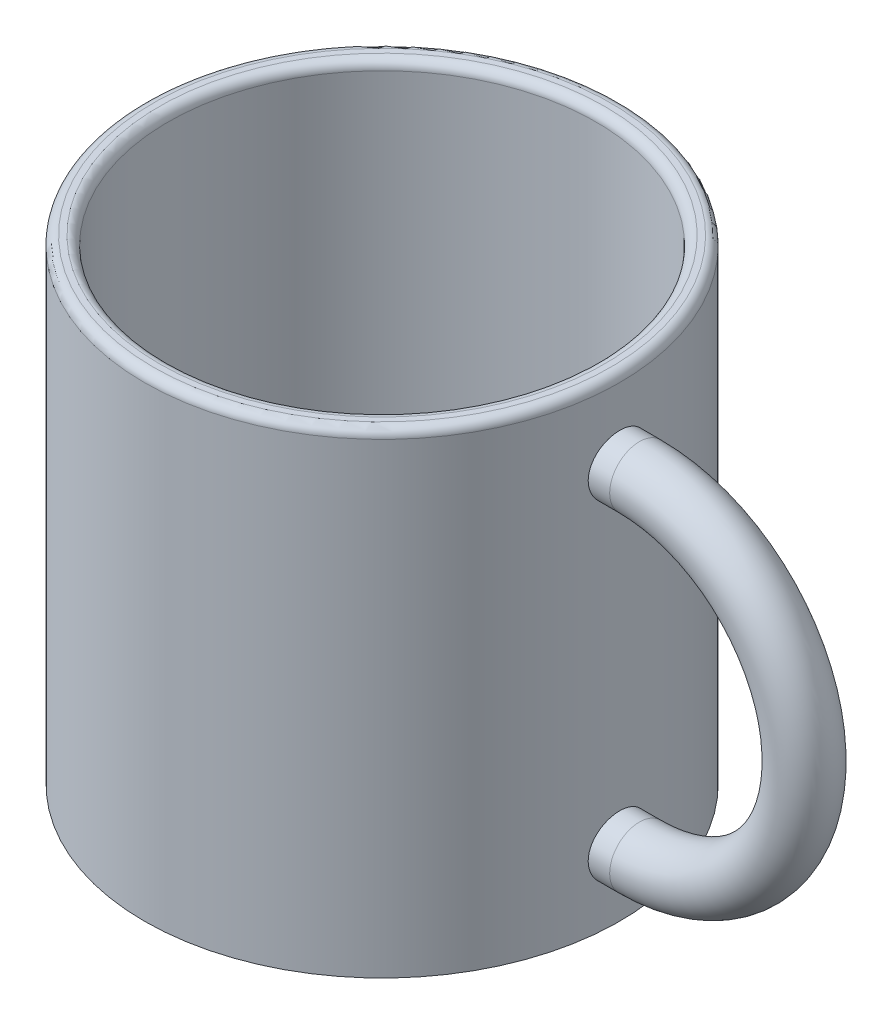
ISO-10303-21;
HEADER;
FILE_DESCRIPTION(('STEP AP214'),'2;1');
FILE_NAME('part.step','',(''),(''),'','','');
FILE_SCHEMA(('AUTOMOTIVE_DESIGN { 1 0 10303 214 1 1 1 1 }'));
ENDSEC;
DATA;
#1=APPLICATION_CONTEXT('core data for automotive mechanical design processes');
#2=APPLICATION_PROTOCOL_DEFINITION('international standard','automotive_design',2000,#1);
#3=PRODUCT_CONTEXT('',#1,'mechanical');
#4=PRODUCT('Part','Part','',(#3));
#5=PRODUCT_RELATED_PRODUCT_CATEGORY('part','',(#4));
#6=PRODUCT_DEFINITION_FORMATION('','',#4);
#7=PRODUCT_DEFINITION_CONTEXT('part definition',#1,'design');
#8=PRODUCT_DEFINITION('design','',#6,#7);
#9=PRODUCT_DEFINITION_SHAPE('','',#8);
#10=(LENGTH_UNIT() NAMED_UNIT(*) SI_UNIT(.MILLI.,.METRE.));
#11=(NAMED_UNIT(*) PLANE_ANGLE_UNIT() SI_UNIT($,.RADIAN.));
#12=(NAMED_UNIT(*) SI_UNIT($,.STERADIAN.) SOLID_ANGLE_UNIT());
#13=UNCERTAINTY_MEASURE_WITH_UNIT(LENGTH_MEASURE(1.E-05),#10,'distance_accuracy_value','');
#14=(GEOMETRIC_REPRESENTATION_CONTEXT(3) GLOBAL_UNCERTAINTY_ASSIGNED_CONTEXT((#13)) GLOBAL_UNIT_ASSIGNED_CONTEXT((#10,
#11,#12)) REPRESENTATION_CONTEXT('',''));
#15=CARTESIAN_POINT('',(0.,0.,0.));
#16=DIRECTION('',(0.,0.,1.));
#17=DIRECTION('',(1.,0.,0.));
#18=AXIS2_PLACEMENT_3D('',#15,#16,#17);
#19=CARTESIAN_POINT('',(-4.40205199535898,86.4092479750852,5.04830324464003E-06));
#20=DIRECTION('',(0.,-1.,0.));
#21=DIRECTION('',(0.,0.,-1.));
#22=AXIS2_PLACEMENT_3D('',#19,#20,#21);
#23=CYLINDRICAL_SURFACE('',#22,60.);
#24=CARTESIAN_POINT('',(-4.40205199535898,84.1592479750852,5.04830324464003E-06));
#25=DIRECTION('',(0.,1.,0.));
#26=DIRECTION('',(0.,0.,1.));
#27=AXIS2_PLACEMENT_3D('',#24,#25,#26);
#28=CIRCLE('',#27,60.);
#29=CARTESIAN_POINT('',(-4.40205199535898,84.1592479750852,60.0000050483032));
#30=VERTEX_POINT('',#29);
#31=EDGE_CURVE('E57',#30,#30,#28,.F.);
#32=ORIENTED_EDGE('',*,*,#31,.T.);
#33=EDGE_LOOP('',(#32));
#34=FACE_BOUND('',#33,.T.);
#35=CARTESIAN_POINT('',(55.1273525035943,-16.9317475000279,7.50000504830325));
#36=CARTESIAN_POINT('',(55.1273516728842,-16.7219195231285,7.50000745762795));
#37=CARTESIAN_POINT('',(55.128464141222,-16.5121268971961,7.49119634433972));
#38=CARTESIAN_POINT('',(55.1328804109412,-16.0939752839577,7.45601962138458));
#39=CARTESIAN_POINT('',(55.1361847091381,-15.8856166325072,7.42965003178556));
#40=CARTESIAN_POINT('',(55.1448940245418,-15.4717370014469,7.35952013181566));
#41=CARTESIAN_POINT('',(55.1503006072433,-15.2662182549915,7.3157468610097));
#42=CARTESIAN_POINT('',(55.1630607297109,-14.8595573749985,7.21111609212237));
#43=CARTESIAN_POINT('',(55.1704149827241,-14.6584168740589,7.15025233492224));
#44=CARTESIAN_POINT('',(55.1868498443608,-14.2622228212685,7.01196738741146));
#45=CARTESIAN_POINT('',(55.1959286263393,-14.0671630808122,6.93456370567615));
#46=CARTESIAN_POINT('',(55.2155624673227,-13.6842037034179,6.76369039077563));
#47=CARTESIAN_POINT('',(55.2261180698112,-13.4963067349859,6.67021484010202));
#48=CARTESIAN_POINT('',(55.2483975379972,-13.129157226942,6.4679422607008));
#49=CARTESIAN_POINT('',(55.2601207612263,-12.9499000131158,6.35915364432168));
#50=CARTESIAN_POINT('',(55.2844143934686,-12.6010944084622,6.12694207345108));
#51=CARTESIAN_POINT('',(55.2969851153869,-12.4315496467772,6.00351370090322));
#52=CARTESIAN_POINT('',(55.3226763998821,-12.1026491172853,5.74231406331745));
#53=CARTESIAN_POINT('',(55.3357992395275,-11.9433441802939,5.60447901274513));
#54=CARTESIAN_POINT('',(55.36217432025,-11.6368372054655,5.31585439025784));
#55=CARTESIAN_POINT('',(55.3754266073903,-11.4896396656036,5.1650600460445));
#56=CARTESIAN_POINT('',(55.4016781603871,-11.2084852999894,4.85166168652769));
#57=CARTESIAN_POINT('',(55.414677505339,-11.0745242799379,4.6890614407144));
#58=CARTESIAN_POINT('',(55.4400664724729,-10.8206835761457,4.3530779872731));
#59=CARTESIAN_POINT('',(55.4524558679777,-10.7008091048197,4.1796908242546));
#60=CARTESIAN_POINT('',(55.4763081842913,-10.4756968924043,3.8228382803089));
#61=CARTESIAN_POINT('',(55.4877680864048,-10.3705060996266,3.6393430760415));
#62=CARTESIAN_POINT('',(55.5093930467323,-10.1759650109121,3.26406290418867));
#63=CARTESIAN_POINT('',(55.5195580901868,-10.086614895529,3.07227784214552));
#64=CARTESIAN_POINT('',(55.5383037186305,-9.92441298521699,2.68178775546673));
#65=CARTESIAN_POINT('',(55.5468843746456,-9.85156045068942,2.48308304150512));
#66=CARTESIAN_POINT('',(55.5622173433109,-9.7228861789936,2.08016019281935));
#67=CARTESIAN_POINT('',(55.5689696235095,-9.66706474410576,1.87594196030726));
#68=CARTESIAN_POINT('',(55.5804214125878,-9.57312798956593,1.46458189403989));
#69=CARTESIAN_POINT('',(55.5851318531583,-9.53491830780717,1.25746191585353));
#70=CARTESIAN_POINT('',(55.5924211857867,-9.47603402838851,0.840636936892192));
#71=CARTESIAN_POINT('',(55.594999340431,-9.45536549696341,0.630931067256711));
#72=CARTESIAN_POINT('',(55.5979461398982,-9.43175204586593,0.210576673230824));
#73=CARTESIAN_POINT('',(55.5983156566915,-9.42880013166991,-7.14462842571961E-05));
#74=CARTESIAN_POINT('',(55.5968419664935,-9.44060310419811,-0.420884280927014));
#75=CARTESIAN_POINT('',(55.5949979441519,-9.45536451557111,-0.63104878934133));
#76=CARTESIAN_POINT('',(55.5862331722374,-9.52587045831438,-1.25604095759549));
#77=CARTESIAN_POINT('',(55.5760985352602,-9.60768148533513,-1.66820162834498));
#78=CARTESIAN_POINT('',(55.5483308259854,-9.83870174006814,-2.47266838533065));
#79=CARTESIAN_POINT('',(55.5306976111372,-9.9879122490705,-2.86497409395868));
#80=CARTESIAN_POINT('',(55.4898354313784,-10.3499167873245,-3.62010338999481));
#81=CARTESIAN_POINT('',(55.4665915375175,-10.5628808219484,-3.98284480888444));
#82=CARTESIAN_POINT('',(55.417107159024,-11.0462226379485,-4.66757213517145));
#83=CARTESIAN_POINT('',(55.3908665369861,-11.3166030524558,-4.98955617234271));
#84=CARTESIAN_POINT('',(55.3381140080176,-11.909302941705,-5.58595773815715));
#85=CARTESIAN_POINT('',(55.3116014727174,-12.2319647739785,-5.86003512315752));
#86=CARTESIAN_POINT('',(55.2614701689239,-12.9188921750647,-6.3501938521004));
#87=CARTESIAN_POINT('',(55.2378514095015,-13.2831578742818,-6.56627501425089));
#88=CARTESIAN_POINT('',(55.1961820810887,-14.0432559820732,-6.93432858415866));
#89=CARTESIAN_POINT('',(55.1781338802185,-14.4391017260104,-7.08627373688786));
#90=CARTESIAN_POINT('',(55.149695281186,-15.2509658744849,-7.3214399194967));
#91=CARTESIAN_POINT('',(55.1393045139736,-15.6669833058174,-7.4046642614001));
#92=CARTESIAN_POINT('',(55.127424663463,-16.504376995507,-7.49957631764126));
#93=CARTESIAN_POINT('',(55.1258760108214,-16.9256981815849,-7.51174276195565));
#94=CARTESIAN_POINT('',(55.131698255321,-17.7643734767296,-7.46545552713046));
#95=CARTESIAN_POINT('',(55.1390689623467,-18.1817276701615,-7.40700335322208));
#96=CARTESIAN_POINT('',(55.161844795713,-18.9991840928271,-7.22154587229716));
#97=CARTESIAN_POINT('',(55.177222749094,-19.3993397450095,-7.09477236624995));
#98=CARTESIAN_POINT('',(55.2142593401604,-20.1727225652684,-6.77649214559088));
#99=CARTESIAN_POINT('',(55.2359181985092,-20.5459487866737,-6.58498315662677));
#100=CARTESIAN_POINT('',(55.2832150584343,-21.2570016752939,-6.14155588708251));
#101=CARTESIAN_POINT('',(55.3088734690709,-21.5946309964594,-5.88932393772638));
#102=CARTESIAN_POINT('',(55.3612285089834,-22.2230536627647,-5.33181154934117));
#103=CARTESIAN_POINT('',(55.3879251786117,-22.5138451852668,-5.02652904687287));
#104=CARTESIAN_POINT('',(55.426567247063,-22.9092962160535,-4.53472057159022));
#105=CARTESIAN_POINT('',(55.4392543205326,-23.0346754666651,-4.36450785400844));
#106=CARTESIAN_POINT('',(55.4637799861621,-23.2706425254571,-4.01408817988717));
#107=CARTESIAN_POINT('',(55.4756188900036,-23.3812357802067,-3.83388493825285));
#108=CARTESIAN_POINT('',(55.4981166979563,-23.5868711594592,-3.46467646467589));
#109=CARTESIAN_POINT('',(55.5087751896826,-23.6819078546839,-3.27566818919246));
#110=CARTESIAN_POINT('',(55.5286024212752,-23.8556762369068,-2.89029994381967));
#111=CARTESIAN_POINT('',(55.5377716884877,-23.9344136983175,-2.69394260673105));
#112=CARTESIAN_POINT('',(55.554342895809,-24.0748661366292,-2.29571378590778));
#113=CARTESIAN_POINT('',(55.5617492066624,-24.1366232716666,-2.09385735151423));
#114=CARTESIAN_POINT('',(55.5746136993204,-24.2429180013362,-1.68560349392137));
#115=CARTESIAN_POINT('',(55.5800719262674,-24.2874559949858,-1.47920617606461));
#116=CARTESIAN_POINT('',(55.5888850070858,-24.3589801021919,-1.06335182259545));
#117=CARTESIAN_POINT('',(55.5922399011966,-24.385966551532,-0.853894845596655));
#118=CARTESIAN_POINT('',(55.5967507630997,-24.4221851821885,-0.433431499046688));
#119=CARTESIAN_POINT('',(55.597906775446,-24.4314177232355,-0.222425160975727));
#120=CARTESIAN_POINT('',(55.5979867970588,-24.4320577829696,0.198211888497949));
#121=CARTESIAN_POINT('',(55.5969255817518,-24.423583299816,0.407842427082098));
#122=CARTESIAN_POINT('',(55.5926316679839,-24.3891169596966,0.825562219588639));
#123=CARTESIAN_POINT('',(55.5893997292367,-24.3631312313365,1.03365198700132));
#124=CARTESIAN_POINT('',(55.5808552319251,-24.293835501424,1.44692137129249));
#125=CARTESIAN_POINT('',(55.575542297486,-24.2505223701207,1.65210045549434));
#126=CARTESIAN_POINT('',(55.562985150777,-24.1468928343142,2.05805296620777));
#127=CARTESIAN_POINT('',(55.5557409794309,-24.0865767901081,2.25882648597748));
#128=CARTESIAN_POINT('',(55.5395270057377,-23.9494056491818,2.65449204687226));
#129=CARTESIAN_POINT('',(55.5305577939761,-23.8725562117763,2.84938607456066));
#130=CARTESIAN_POINT('',(55.5111426629522,-23.7028622019309,3.23200185097219));
#131=CARTESIAN_POINT('',(55.5006967582042,-23.6100177867043,3.41972367016819));
#132=CARTESIAN_POINT('',(55.4786169753045,-23.4089765052994,3.78673065235454));
#133=CARTESIAN_POINT('',(55.4669828715923,-23.3007767226293,3.96601420400498));
#134=CARTESIAN_POINT('',(55.4428562089809,-23.0698428742534,4.31480710435327));
#135=CARTESIAN_POINT('',(55.4303639596409,-22.9471140381844,4.48431993748717));
#136=CARTESIAN_POINT('',(55.4047757056614,-22.6870488824675,4.8136135180227));
#137=CARTESIAN_POINT('',(55.3916761220878,-22.5496173813515,4.9733188256801));
#138=CARTESIAN_POINT('',(55.3653278141784,-22.2618696141698,5.28054280450673));
#139=CARTESIAN_POINT('',(55.3520791456317,-22.1115580372396,5.42806587266968));
#140=CARTESIAN_POINT('',(55.3257931517462,-21.7989592927908,5.71004739802776));
#141=CARTESIAN_POINT('',(55.3127559590657,-21.6366649378372,5.84449790025711));
#142=CARTESIAN_POINT('',(55.2872745169921,-21.3013729027553,6.09924160725989));
#143=CARTESIAN_POINT('',(55.2748300504189,-21.1283791972045,6.21954002160365));
#144=CARTESIAN_POINT('',(55.2508310649251,-20.7720829403043,6.44566490249995));
#145=CARTESIAN_POINT('',(55.2392805470925,-20.5887397540392,6.55142778324764));
#146=CARTESIAN_POINT('',(55.2174644170038,-20.2137820816202,6.74707495648724));
#147=CARTESIAN_POINT('',(55.2071983337479,-20.0221706622812,6.83696507449473));
#148=CARTESIAN_POINT('',(55.1882500935756,-19.6321184723321,7.00019441528185));
#149=CARTESIAN_POINT('',(55.1795667007223,-19.4336831757496,7.07354656340961));
#150=CARTESIAN_POINT('',(55.1640273250525,-19.0313270764244,7.20322988204138));
#151=CARTESIAN_POINT('',(55.1571709109582,-18.827407580821,7.259565070001));
#152=CARTESIAN_POINT('',(55.1434793120096,-18.3447727190325,7.37116046492179));
#153=CARTESIAN_POINT('',(55.1374576743433,-18.0643879946232,7.41942740908913));
#154=CARTESIAN_POINT('',(55.129394847498,-17.4998964013695,7.48384794821455));
#155=CARTESIAN_POINT('',(55.1273536281184,-17.2157895607823,7.50000178682419));
#156=CARTESIAN_POINT('',(55.1273525035943,-16.9317475000279,7.50000504830325));
#157=B_SPLINE_CURVE_WITH_KNOTS('',3,(#35,#36,#37,#38,#39,#40,#41,#42,#43,#44,#45,#46,#47,#48,
#49,#50,#51,#52,#53,#54,#55,#56,#57,#58,#59,#60,#61,#62,#63,#64,#65,#66,#67,#68,#69,#70,#71,#72,
#73,#74,#75,#76,#77,#78,#79,#80,#81,#82,#83,#84,#85,#86,#87,#88,#89,#90,#91,#92,#93,#94,#95,#96,
#97,#98,#99,#100,#101,#102,#103,#104,#105,#106,#107,#108,#109,#110,#111,#112,#113,#114,#115,
#116,#117,#118,#119,#120,#121,#122,#123,#124,#125,#126,#127,#128,#129,#130,#131,#132,#133,#134,
#135,#136,#137,#138,#139,#140,#141,#142,#143,#144,#145,#146,#147,#148,#149,#150,#151,#152,#153,
#154,#155,#156),.UNSPECIFIED.,.T.,.F.,(4,2,2,2,2,2,2,2,2,2,2,2,2,2,2,2,2,2,2,2,2,2,2,2,2,2,2,2,
2,2,2,2,2,2,2,2,2,2,2,2,2,2,2,2,2,2,2,2,2,2,2,2,2,2,2,2,2,2,2,2,4),(0.,0.629235324624849,
1.25861332488502,1.88846090034761,2.51853944899679,3.14795429413481,3.77760138201524,
4.40690390878109,5.03644006637225,5.66889211451574,6.30157807125906,6.93406289945341,
7.56678103253858,8.2014779675225,8.83618213638638,9.47085784536276,10.1055448183727,
10.7367904965995,11.3682543889034,11.9994689627422,12.6309161139088,13.8854025867967,
15.1399129089592,16.3977987711896,17.6557423328786,18.9222835601386,20.1888287573883,
21.4559116409758,22.7229334534912,23.981409172982,25.239858068619,26.4940639275875,
27.7483138551611,29.0091872251288,30.2701096486498,30.9048473756283,31.539350642615,
32.1740748828505,32.8085738697948,33.4414830211465,34.0743775052848,34.7072598809829,
35.3401294330456,35.9687950485062,36.5972407570427,37.2258000294613,37.8543459835114,
38.482677130125,39.1110021012775,39.7394465722238,40.3676655225966,41.000230518052,
41.6325661917027,42.2652842794141,42.89776872157,43.5329374317485,44.1678725398156,
44.8023096769907,45.4365969155535,46.2883930250815,47.1401826717573),.UNSPECIFIED.);
#158=CARTESIAN_POINT('',(55.1273525035943,-16.9317475000279,7.50000504830325));
#159=VERTEX_POINT('',#158);
#160=EDGE_CURVE('E69',#159,#159,#157,.T.);
#161=ORIENTED_EDGE('',*,*,#160,.T.);
#162=EDGE_LOOP('',(#161));
#163=FACE_BOUND('',#162,.T.);
#164=CARTESIAN_POINT('',(-4.40205199535898,-33.5907520249148,5.04830324464003E-06));
#165=DIRECTION('',(0.,1.,0.));
#166=DIRECTION('',(0.,0.,1.));
#167=AXIS2_PLACEMENT_3D('',#164,#165,#166);
#168=CIRCLE('',#167,60.);
#169=CARTESIAN_POINT('',(-4.40205199535898,-33.5907520249148,60.0000050483032));
#170=VERTEX_POINT('',#169);
#171=EDGE_CURVE('E77',#170,#170,#168,.T.);
#172=ORIENTED_EDGE('',*,*,#171,.T.);
#173=EDGE_LOOP('',(#172));
#174=FACE_BOUND('',#173,.T.);
#175=CARTESIAN_POINT('',(55.1273525035943,66.2282524999721,7.50000504830325));
#176=CARTESIAN_POINT('',(55.1273516728842,66.0184245230726,7.50000745762795));
#177=CARTESIAN_POINT('',(55.128464141222,65.8086318971403,7.49119634433972));
#178=CARTESIAN_POINT('',(55.1328804109412,65.3904802839018,7.45601962138458));
#179=CARTESIAN_POINT('',(55.1361847091381,65.1821216324514,7.42965003178557));
#180=CARTESIAN_POINT('',(55.1448940245418,64.7682420013911,7.35952013181566));
#181=CARTESIAN_POINT('',(55.1503006072433,64.5627232549356,7.3157468610097));
#182=CARTESIAN_POINT('',(55.1630607297109,64.1560623749426,7.21111609212237));
#183=CARTESIAN_POINT('',(55.1704149827241,63.954921874003,7.15025233492224));
#184=CARTESIAN_POINT('',(55.1868498443608,63.5587278212127,7.01196738741146));
#185=CARTESIAN_POINT('',(55.1959286263393,63.3636680807564,6.93456370567615));
#186=CARTESIAN_POINT('',(55.2155624673227,62.980708703362,6.76369039077564));
#187=CARTESIAN_POINT('',(55.2261180698112,62.7928117349301,6.67021484010202));
#188=CARTESIAN_POINT('',(55.2483975379972,62.4256622268862,6.4679422607008));
#189=CARTESIAN_POINT('',(55.2601207612263,62.24640501306,6.35915364432168));
#190=CARTESIAN_POINT('',(55.2844143934686,61.8975994084064,6.12694207345108));
#191=CARTESIAN_POINT('',(55.2969851153869,61.7280546467213,6.00351370090322));
#192=CARTESIAN_POINT('',(55.3226763998821,61.3991541172294,5.74231406331745));
#193=CARTESIAN_POINT('',(55.3357992395275,61.239849180238,5.60447901274512));
#194=CARTESIAN_POINT('',(55.36217432025,60.9333422054096,5.31585439025784));
#195=CARTESIAN_POINT('',(55.3754266073903,60.7861446655478,5.1650600460445));
#196=CARTESIAN_POINT('',(55.4016781603871,60.5049902999335,4.85166168652769));
#197=CARTESIAN_POINT('',(55.414677505339,60.3710292798821,4.6890614407144));
#198=CARTESIAN_POINT('',(55.440066472473,60.1171885760899,4.3530779872731));
#199=CARTESIAN_POINT('',(55.4524558679777,59.9973141047638,4.17969082425461));
#200=CARTESIAN_POINT('',(55.4763081842913,59.7722018923485,3.82283828030891));
#201=CARTESIAN_POINT('',(55.4877680864048,59.6670110995708,3.63934307604151));
#202=CARTESIAN_POINT('',(55.5093930467323,59.4724700108562,3.26406290418868));
#203=CARTESIAN_POINT('',(55.5195580901868,59.3831198954732,3.07227784214553));
#204=CARTESIAN_POINT('',(55.5383037186305,59.2209179851612,2.68178775546675));
#205=CARTESIAN_POINT('',(55.5468843746456,59.1480654506336,2.48308304150513));
#206=CARTESIAN_POINT('',(55.5622173433109,59.0193911789378,2.08016019281936));
#207=CARTESIAN_POINT('',(55.5689696235095,58.9635697440499,1.87594196030727));
#208=CARTESIAN_POINT('',(55.5804214125878,58.8696329895101,1.4645818940399));
#209=CARTESIAN_POINT('',(55.5851318531583,58.8314233077513,1.25746191585355));
#210=CARTESIAN_POINT('',(55.5924211857867,58.7725390283327,0.840636936892203));
#211=CARTESIAN_POINT('',(55.594999340431,58.7518704969076,0.630931067256722));
#212=CARTESIAN_POINT('',(55.5979461398982,58.7282570458101,0.210576673230835));
#213=CARTESIAN_POINT('',(55.5983156566915,58.7253051316141,-7.14462842467335E-05));
#214=CARTESIAN_POINT('',(55.5968419664935,58.7371081041423,-0.420884280927003));
#215=CARTESIAN_POINT('',(55.5949979441519,58.7518695155153,-0.631048789341319));
#216=CARTESIAN_POINT('',(55.5862331722374,58.8223754582585,-1.25604095759547));
#217=CARTESIAN_POINT('',(55.5760985352602,58.9041864852793,-1.66820162834497));
#218=CARTESIAN_POINT('',(55.5483308259854,59.1352067400123,-2.47266838533063));
#219=CARTESIAN_POINT('',(55.5306976111372,59.2844172490146,-2.86497409395866));
#220=CARTESIAN_POINT('',(55.4898354313784,59.6464217872686,-3.6201033899948));
#221=CARTESIAN_POINT('',(55.4665915375175,59.8593858218925,-3.98284480888442));
#222=CARTESIAN_POINT('',(55.417107159024,60.3427276378926,-4.66757213517144));
#223=CARTESIAN_POINT('',(55.3908665369861,60.6131080524,-4.9895561723427));
#224=CARTESIAN_POINT('',(55.3381140080176,61.2058079416492,-5.58595773815714));
#225=CARTESIAN_POINT('',(55.3116014727174,61.5284697739226,-5.86003512315751));
#226=CARTESIAN_POINT('',(55.2614701689239,62.2153971750089,-6.3501938521004));
#227=CARTESIAN_POINT('',(55.2378514095015,62.5796628742259,-6.56627501425089));
#228=CARTESIAN_POINT('',(55.1961820810887,63.3397609820174,-6.93432858415865));
#229=CARTESIAN_POINT('',(55.1781338802185,63.7356067259545,-7.08627373688785));
#230=CARTESIAN_POINT('',(55.149695281186,64.547470874429,-7.32143991949669));
#231=CARTESIAN_POINT('',(55.1393045139736,64.9634883057615,-7.40466426140009));
#232=CARTESIAN_POINT('',(55.127424663463,65.8008819954511,-7.49957631764127));
#233=CARTESIAN_POINT('',(55.1258760108214,66.222203181529,-7.51174276195565));
#234=CARTESIAN_POINT('',(55.131698255321,67.0608784766737,-7.46545552713046));
#235=CARTESIAN_POINT('',(55.1390689623467,67.4782326701056,-7.40700335322208));
#236=CARTESIAN_POINT('',(55.161844795713,68.2956890927712,-7.22154587229717));
#237=CARTESIAN_POINT('',(55.177222749094,68.6958447449537,-7.09477236624996));
#238=CARTESIAN_POINT('',(55.2142593401604,69.4692275652125,-6.77649214559089));
#239=CARTESIAN_POINT('',(55.2359181985092,69.8424537866179,-6.58498315662679));
#240=CARTESIAN_POINT('',(55.2832150584343,70.5535066752381,-6.14155588708252));
#241=CARTESIAN_POINT('',(55.3088734690709,70.8911359964036,-5.88932393772639));
#242=CARTESIAN_POINT('',(55.3612285089834,71.5195586627089,-5.33181154934117));
#243=CARTESIAN_POINT('',(55.3879251786117,71.810350185211,-5.02652904687287));
#244=CARTESIAN_POINT('',(55.426567247063,72.2058012159976,-4.53472057159022));
#245=CARTESIAN_POINT('',(55.4392543205326,72.3311804666092,-4.36450785400844));
#246=CARTESIAN_POINT('',(55.4637799861621,72.5671475254012,-4.01408817988717));
#247=CARTESIAN_POINT('',(55.4756188900036,72.6777407801509,-3.83388493825285));
#248=CARTESIAN_POINT('',(55.4981166979563,72.8833761594033,-3.46467646467589));
#249=CARTESIAN_POINT('',(55.5087751896826,72.9784128546281,-3.27566818919246));
#250=CARTESIAN_POINT('',(55.5286024212752,73.1521812368509,-2.89029994381968));
#251=CARTESIAN_POINT('',(55.5377716884877,73.2309186982616,-2.69394260673105));
#252=CARTESIAN_POINT('',(55.554342895809,73.3713711365733,-2.29571378590779));
#253=CARTESIAN_POINT('',(55.5617492066624,73.4331282716107,-2.09385735151424));
#254=CARTESIAN_POINT('',(55.5746136993204,73.5394230012804,-1.68560349392139));
#255=CARTESIAN_POINT('',(55.5800719262674,73.58396099493,-1.47920617606462));
#256=CARTESIAN_POINT('',(55.5888850070858,73.6554851021361,-1.06335182259546));
#257=CARTESIAN_POINT('',(55.5922399011966,73.6824715514762,-0.853894845596667));
#258=CARTESIAN_POINT('',(55.5967507630997,73.7186901821326,-0.433431499046704));
#259=CARTESIAN_POINT('',(55.597906775446,73.7279227231797,-0.222425160975746));
#260=CARTESIAN_POINT('',(55.5979867970588,73.7285627829137,0.198211888497928));
#261=CARTESIAN_POINT('',(55.5969255817518,73.7200882997601,0.407842427082077));
#262=CARTESIAN_POINT('',(55.5926316679839,73.6856219596408,0.825562219588617));
#263=CARTESIAN_POINT('',(55.5893997292367,73.6596362312807,1.0336519870013));
#264=CARTESIAN_POINT('',(55.5808552319251,73.5903405013681,1.44692137129247));
#265=CARTESIAN_POINT('',(55.575542297486,73.5470273700649,1.65210045549432));
#266=CARTESIAN_POINT('',(55.562985150777,73.4433978342584,2.05805296620775));
#267=CARTESIAN_POINT('',(55.5557409794309,73.3830817900522,2.25882648597747));
#268=CARTESIAN_POINT('',(55.5395270057377,73.2459106491259,2.65449204687224));
#269=CARTESIAN_POINT('',(55.5305577939761,73.1690612117205,2.84938607456065));
#270=CARTESIAN_POINT('',(55.5111426629522,72.9993672018751,3.23200185097217));
#271=CARTESIAN_POINT('',(55.5006967582042,72.9065227866485,3.41972367016817));
#272=CARTESIAN_POINT('',(55.4786169753045,72.7054815052435,3.78673065235453));
#273=CARTESIAN_POINT('',(55.4669828715924,72.5972817225735,3.96601420400496));
#274=CARTESIAN_POINT('',(55.4428562089809,72.3663478741975,4.31480710435324));
#275=CARTESIAN_POINT('',(55.4303639596409,72.2436190381286,4.48431993748715));
#276=CARTESIAN_POINT('',(55.4047757056614,71.9835538824116,4.81361351802269));
#277=CARTESIAN_POINT('',(55.3916761220878,71.8461223812956,4.97331882568009));
#278=CARTESIAN_POINT('',(55.3653278141784,71.558374614114,5.28054280450672));
#279=CARTESIAN_POINT('',(55.3520791456317,71.4080630371838,5.42806587266967));
#280=CARTESIAN_POINT('',(55.3257931517462,71.095464292735,5.71004739802775));
#281=CARTESIAN_POINT('',(55.3127559590657,70.9331699377813,5.8444979002571));
#282=CARTESIAN_POINT('',(55.2872745169921,70.5978779026995,6.09924160725987));
#283=CARTESIAN_POINT('',(55.2748300504189,70.4248841971487,6.21954002160363));
#284=CARTESIAN_POINT('',(55.2508310649251,70.0685879402485,6.44566490249994));
#285=CARTESIAN_POINT('',(55.2392805470925,69.8852447539833,6.55142778324763));
#286=CARTESIAN_POINT('',(55.2174644170038,69.5102870815643,6.74707495648723));
#287=CARTESIAN_POINT('',(55.2071983337479,69.3186756622254,6.83696507449472));
#288=CARTESIAN_POINT('',(55.1882500935756,68.9286234722763,7.00019441528184));
#289=CARTESIAN_POINT('',(55.1795667007223,68.7301881756938,7.07354656340961));
#290=CARTESIAN_POINT('',(55.1640273250525,68.3278320763686,7.20322988204138));
#291=CARTESIAN_POINT('',(55.1571709109582,68.1239125807652,7.259565070001));
#292=CARTESIAN_POINT('',(55.1434793120096,67.6412777189766,7.37116046492178));
#293=CARTESIAN_POINT('',(55.1374576743433,67.3608929945674,7.41942740908913));
#294=CARTESIAN_POINT('',(55.129394847498,66.7964014013136,7.48384794821455));
#295=CARTESIAN_POINT('',(55.1273536281184,66.5122945607264,7.50000178682419));
#296=CARTESIAN_POINT('',(55.1273525035943,66.2282524999721,7.50000504830325));
#297=B_SPLINE_CURVE_WITH_KNOTS('',3,(#175,#176,#177,#178,#179,#180,#181,#182,#183,#184,#185,
#186,#187,#188,#189,#190,#191,#192,#193,#194,#195,#196,#197,#198,#199,#200,#201,#202,#203,#204,
#205,#206,#207,#208,#209,#210,#211,#212,#213,#214,#215,#216,#217,#218,#219,#220,#221,#222,#223,
#224,#225,#226,#227,#228,#229,#230,#231,#232,#233,#234,#235,#236,#237,#238,#239,#240,#241,#242,
#243,#244,#245,#246,#247,#248,#249,#250,#251,#252,#253,#254,#255,#256,#257,#258,#259,#260,#261,
#262,#263,#264,#265,#266,#267,#268,#269,#270,#271,#272,#273,#274,#275,#276,#277,#278,#279,#280,
#281,#282,#283,#284,#285,#286,#287,#288,#289,#290,#291,#292,#293,#294,#295,#296),.UNSPECIFIED.,
.T.,.F.,(4,2,2,2,2,2,2,2,2,2,2,2,2,2,2,2,2,2,2,2,2,2,2,2,2,2,2,2,2,2,2,2,2,2,2,2,2,2,2,2,2,2,2,
2,2,2,2,2,2,2,2,2,2,2,2,2,2,2,2,2,4),(0.,0.629235324624828,1.258613324885,1.8884609003476,
2.51853944899678,3.1479542941348,3.77760138201524,4.40690390878109,5.03644006637225,
5.66889211451574,6.30157807125905,6.9340628994534,7.56678103253857,8.20147796752249,
8.83618213638636,9.47085784536274,10.1055448183727,10.7367904965995,11.3682543889034,
11.9994689627422,12.6309161139087,13.8854025867966,15.1399129089592,16.3977987711896,
17.6557423328786,18.9222835601386,20.1888287573883,21.4559116409758,22.7229334534911,
23.981409172982,25.2398580686189,26.4940639275875,27.7483138551611,29.0091872251288,
30.2701096486498,30.9048473756283,31.539350642615,32.1740748828506,32.8085738697948,
33.4414830211465,34.0743775052848,34.7072598809829,35.3401294330456,35.9687950485062,
36.5972407570426,37.2258000294613,37.8543459835114,38.4826771301249,39.1110021012775,
39.7394465722238,40.3676655225966,41.000230518052,41.6325661917027,42.2652842794141,
42.8977687215699,43.5329374317484,44.1678725398156,44.8023096769907,45.4365969155535,
46.2883930250815,47.1401826717573),.UNSPECIFIED.);
#298=CARTESIAN_POINT('',(55.1273525035943,66.2282524999721,7.50000504830325));
#299=VERTEX_POINT('',#298);
#300=EDGE_CURVE('E68',#299,#299,#297,.T.);
#301=ORIENTED_EDGE('',*,*,#300,.F.);
#302=EDGE_LOOP('',(#301));
#303=FACE_BOUND('',#302,.T.);
#304=ADVANCED_FACE('F42',(#34,#163,#174,#303),#23,.T.);
#305=CARTESIAN_POINT('',(-4.40205199535898,86.4092479750852,5.04830324464003E-06));
#306=DIRECTION('',(0.,1.,0.));
#307=DIRECTION('',(0.,0.,1.));
#308=AXIS2_PLACEMENT_3D('',#305,#306,#307);
#309=PLANE('',#308);
#310=CARTESIAN_POINT('',(-4.40205199535898,86.4092479750852,5.04830324464003E-06));
#311=DIRECTION('',(0.,1.,0.));
#312=DIRECTION('',(0.,0.,1.));
#313=AXIS2_PLACEMENT_3D('',#310,#311,#312);
#314=CIRCLE('',#313,57.75);
#315=CARTESIAN_POINT('',(-4.40205199535898,86.4092479750852,57.7500050483032));
#316=VERTEX_POINT('',#315);
#317=EDGE_CURVE('E62',#316,#316,#314,.T.);
#318=ORIENTED_EDGE('',*,*,#317,.T.);
#319=EDGE_LOOP('',(#318));
#320=FACE_BOUND('',#319,.T.);
#321=CARTESIAN_POINT('',(-4.40205199535898,86.4092479750852,5.04830324464003E-06));
#322=DIRECTION('',(0.,1.,0.));
#323=DIRECTION('',(0.,0.,1.));
#324=AXIS2_PLACEMENT_3D('',#321,#322,#323);
#325=CIRCLE('',#324,56.25);
#326=CARTESIAN_POINT('',(-4.40205199535898,86.4092479750852,56.2500050483033));
#327=VERTEX_POINT('',#326);
#328=EDGE_CURVE('E65',#327,#327,#325,.F.);
#329=ORIENTED_EDGE('',*,*,#328,.T.);
#330=EDGE_LOOP('',(#329));
#331=FACE_BOUND('',#330,.T.);
#332=ADVANCED_FACE('F96',(#320,#331),#309,.T.);
#333=CARTESIAN_POINT('',(-4.40205199535898,-33.5907520249148,5.04830324464003E-06));
#334=DIRECTION('',(0.,1.,0.));
#335=DIRECTION('',(0.,0.,1.));
#336=AXIS2_PLACEMENT_3D('',#333,#334,#335);
#337=PLANE('',#336);
#338=ORIENTED_EDGE('',*,*,#171,.F.);
#339=EDGE_LOOP('',(#338));
#340=FACE_BOUND('',#339,.T.);
#341=ADVANCED_FACE('F93',(#340),#337,.F.);
#342=CARTESIAN_POINT('',(60.547948004641,-16.9317475000279,5.04830324464003E-06));
#343=DIRECTION('',(-1.,0.,0.));
#344=DIRECTION('',(0.,0.,1.));
#345=AXIS2_PLACEMENT_3D('',#342,#343,#344);
#346=CYLINDRICAL_SURFACE('',#345,7.5);
#347=CARTESIAN_POINT('',(60.547948004641,-16.9317475000279,5.04830324464003E-06));
#348=DIRECTION('',(-1.,0.,0.));
#349=DIRECTION('',(0.,0.,-1.));
#350=AXIS2_PLACEMENT_3D('',#347,#348,#349);
#351=CIRCLE('',#350,7.5);
#352=CARTESIAN_POINT('',(60.547948004641,-24.4317475000279,5.04830324464003E-06));
#353=VERTEX_POINT('',#352);
#354=EDGE_CURVE('E78',#353,#353,#351,.T.);
#355=ORIENTED_EDGE('',*,*,#354,.T.);
#356=EDGE_LOOP('',(#355));
#357=FACE_BOUND('',#356,.T.);
#358=ORIENTED_EDGE('',*,*,#160,.F.);
#359=EDGE_LOOP('',(#358));
#360=FACE_BOUND('',#359,.T.);
#361=ADVANCED_FACE('F87',(#357,#360),#346,.T.);
#362=CARTESIAN_POINT('',(60.547948004641,66.2282524999721,5.04830324464003E-06));
#363=DIRECTION('',(-1.,0.,0.));
#364=DIRECTION('',(0.,0.,1.));
#365=AXIS2_PLACEMENT_3D('',#362,#363,#364);
#366=CYLINDRICAL_SURFACE('',#365,7.5);
#367=CARTESIAN_POINT('',(60.547948004641,66.2282524999721,5.04830324464003E-06));
#368=DIRECTION('',(1.,0.,0.));
#369=DIRECTION('',(0.,0.,-1.));
#370=AXIS2_PLACEMENT_3D('',#367,#368,#369);
#371=CIRCLE('',#370,7.5);
#372=CARTESIAN_POINT('',(60.547948004641,73.7282524999721,5.04830324464003E-06));
#373=VERTEX_POINT('',#372);
#374=EDGE_CURVE('E120',#373,#373,#371,.T.);
#375=ORIENTED_EDGE('',*,*,#374,.F.);
#376=EDGE_LOOP('',(#375));
#377=FACE_BOUND('',#376,.T.);
#378=ORIENTED_EDGE('',*,*,#300,.T.);
#379=EDGE_LOOP('',(#378));
#380=FACE_BOUND('',#379,.T.);
#381=ADVANCED_FACE('F92',(#377,#380),#366,.T.);
#382=CARTESIAN_POINT('',(60.547948004641,24.6482524999721,5.04830324464003E-06));
#383=DIRECTION('',(0.,0.,-1.));
#384=DIRECTION('',(-1.,0.,0.));
#385=AXIS2_PLACEMENT_3D('',#382,#383,#384);
#386=TOROIDAL_SURFACE('',#385,41.58,7.5);
#387=CARTESIAN_POINT('',(60.547948004641,24.6482524999721,5.04830324464003E-06));
#388=DIRECTION('',(0.,0.,-1.));
#389=DIRECTION('',(-1.,0.,0.));
#390=AXIS2_PLACEMENT_3D('',#387,#388,#389);
#391=CIRCLE('',#390,49.08);
#392=EDGE_CURVE('',#373,#353,#391,.T.);
#393=ORIENTED_EDGE('',*,*,#374,.T.);
#394=ORIENTED_EDGE('',*,*,#354,.F.);
#395=ORIENTED_EDGE('',*,*,#392,.T.);
#396=ORIENTED_EDGE('',*,*,#392,.F.);
#397=EDGE_LOOP('',(#393,#395,#394,#396));
#398=FACE_BOUND('',#397,.T.);
#399=ADVANCED_FACE('F95',(#398),#386,.T.);
#400=CARTESIAN_POINT('',(-4.40205199535898,-186.325816761209,5.04830324464003E-06));
#401=DIRECTION('',(0.,1.,0.));
#402=DIRECTION('',(0.,0.,1.));
#403=AXIS2_PLACEMENT_3D('',#400,#401,#402);
#404=CYLINDRICAL_SURFACE('',#403,54.);
#405=CARTESIAN_POINT('',(-4.40205199535898,-25.3407520249148,5.04830324464003E-06));
#406=DIRECTION('',(0.,1.,0.));
#407=DIRECTION('',(0.,0.,1.));
#408=AXIS2_PLACEMENT_3D('',#405,#406,#407);
#409=CIRCLE('',#408,54.);
#410=CARTESIAN_POINT('',(-4.40205199535898,-25.3407520249148,54.0000050483033));
#411=VERTEX_POINT('',#410);
#412=EDGE_CURVE('E49',#411,#411,#409,.F.);
#413=ORIENTED_EDGE('',*,*,#412,.T.);
#414=EDGE_LOOP('',(#413));
#415=FACE_BOUND('',#414,.T.);
#416=CARTESIAN_POINT('',(-4.40205199535898,84.1592479750852,5.04830324464003E-06));
#417=DIRECTION('',(0.,1.,0.));
#418=DIRECTION('',(0.,0.,1.));
#419=AXIS2_PLACEMENT_3D('',#416,#417,#418);
#420=CIRCLE('',#419,54.);
#421=CARTESIAN_POINT('',(-4.40205199535898,84.1592479750852,54.0000050483033));
#422=VERTEX_POINT('',#421);
#423=EDGE_CURVE('E53',#422,#422,#420,.T.);
#424=ORIENTED_EDGE('',*,*,#423,.T.);
#425=EDGE_LOOP('',(#424));
#426=FACE_BOUND('',#425,.T.);
#427=ADVANCED_FACE('F130',(#415,#426),#404,.F.);
#428=CARTESIAN_POINT('',(-4.40205199535898,-27.5907520249148,5.04830324464003E-06));
#429=DIRECTION('',(0.,1.,0.));
#430=DIRECTION('',(0.,0.,1.));
#431=AXIS2_PLACEMENT_3D('',#428,#429,#430);
#432=PLANE('',#431);
#433=CARTESIAN_POINT('',(-4.40205199535898,-27.5907520249148,5.04830324464003E-06));
#434=DIRECTION('',(0.,1.,0.));
#435=DIRECTION('',(0.,0.,1.));
#436=AXIS2_PLACEMENT_3D('',#433,#434,#435);
#437=CIRCLE('',#436,51.75);
#438=CARTESIAN_POINT('',(-4.40205199535898,-27.5907520249148,51.7500050483033));
#439=VERTEX_POINT('',#438);
#440=EDGE_CURVE('E11',#439,#439,#437,.T.);
#441=ORIENTED_EDGE('',*,*,#440,.T.);
#442=EDGE_LOOP('',(#441));
#443=FACE_BOUND('',#442,.T.);
#444=ADVANCED_FACE('F135',(#443),#432,.T.);
#445=CARTESIAN_POINT('',(-4.40205199535898,84.1592479750852,5.04830324464003E-06));
#446=DIRECTION('',(0.,1.,0.));
#447=DIRECTION('',(0.,0.,1.));
#448=AXIS2_PLACEMENT_3D('',#445,#446,#447);
#449=TOROIDAL_SURFACE('',#448,57.75,2.25);
#450=ORIENTED_EDGE('',*,*,#31,.F.);
#451=EDGE_LOOP('',(#450));
#452=FACE_BOUND('',#451,.T.);
#453=ORIENTED_EDGE('',*,*,#317,.F.);
#454=EDGE_LOOP('',(#453));
#455=FACE_BOUND('',#454,.T.);
#456=ADVANCED_FACE('F137',(#452,#455),#449,.T.);
#457=CARTESIAN_POINT('',(-4.40205199535898,84.1592479750852,5.04830324464003E-06));
#458=DIRECTION('',(0.,1.,0.));
#459=DIRECTION('',(0.,0.,1.));
#460=AXIS2_PLACEMENT_3D('',#457,#458,#459);
#461=TOROIDAL_SURFACE('',#460,56.25,2.25);
#462=ORIENTED_EDGE('',*,*,#328,.F.);
#463=EDGE_LOOP('',(#462));
#464=FACE_BOUND('',#463,.T.);
#465=ORIENTED_EDGE('',*,*,#423,.F.);
#466=EDGE_LOOP('',(#465));
#467=FACE_BOUND('',#466,.T.);
#468=ADVANCED_FACE('F141',(#464,#467),#461,.T.);
#469=CARTESIAN_POINT('',(-4.40205199535898,-25.3407520249148,5.04830324464003E-06));
#470=DIRECTION('',(0.,1.,0.));
#471=DIRECTION('',(0.,0.,1.));
#472=AXIS2_PLACEMENT_3D('',#469,#470,#471);
#473=TOROIDAL_SURFACE('',#472,51.75,2.25);
#474=ORIENTED_EDGE('',*,*,#440,.F.);
#475=EDGE_LOOP('',(#474));
#476=FACE_BOUND('',#475,.T.);
#477=ORIENTED_EDGE('',*,*,#412,.F.);
#478=EDGE_LOOP('',(#477));
#479=FACE_BOUND('',#478,.T.);
#480=ADVANCED_FACE('F44',(#476,#479),#473,.F.);
#481=CLOSED_SHELL('',(#304,#332,#341,#361,#381,#399,#427,#444,#456,#468,#480));
#482=MANIFOLD_SOLID_BREP('B2',#481);
#483=ADVANCED_BREP_SHAPE_REPRESENTATION('',(#18,#482),#14);
#484=SHAPE_DEFINITION_REPRESENTATION(#9,#483);
ENDSEC;
END-ISO-10303-21;
